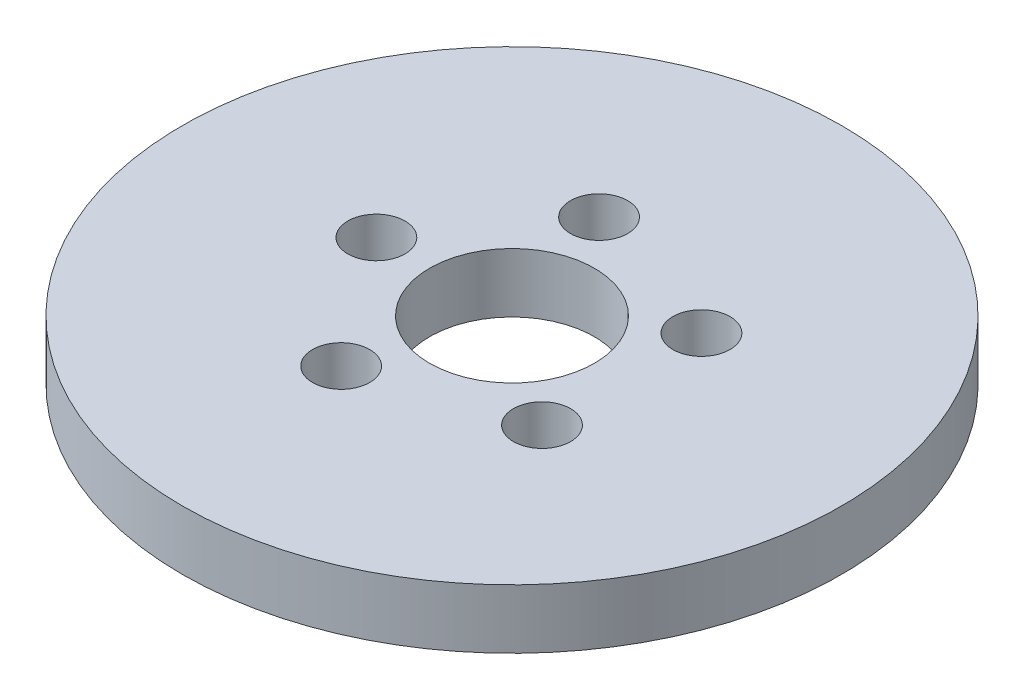
ISO-10303-21;
HEADER;
FILE_DESCRIPTION(('STEP AP214'),'2;1');
FILE_NAME('part.step','',(''),(''),'','','');
FILE_SCHEMA(('AUTOMOTIVE_DESIGN { 1 0 10303 214 1 1 1 1 }'));
ENDSEC;
DATA;
#1=APPLICATION_CONTEXT('core data for automotive mechanical design processes');
#2=APPLICATION_PROTOCOL_DEFINITION('international standard','automotive_design',2000,#1);
#3=PRODUCT_CONTEXT('',#1,'mechanical');
#4=PRODUCT('Part','Part','',(#3));
#5=PRODUCT_RELATED_PRODUCT_CATEGORY('part','',(#4));
#6=PRODUCT_DEFINITION_FORMATION('','',#4);
#7=PRODUCT_DEFINITION_CONTEXT('part definition',#1,'design');
#8=PRODUCT_DEFINITION('design','',#6,#7);
#9=PRODUCT_DEFINITION_SHAPE('','',#8);
#10=(LENGTH_UNIT() NAMED_UNIT(*) SI_UNIT(.MILLI.,.METRE.));
#11=(NAMED_UNIT(*) PLANE_ANGLE_UNIT() SI_UNIT($,.RADIAN.));
#12=(NAMED_UNIT(*) SI_UNIT($,.STERADIAN.) SOLID_ANGLE_UNIT());
#13=UNCERTAINTY_MEASURE_WITH_UNIT(LENGTH_MEASURE(1.E-05),#10,'distance_accuracy_value','');
#14=(GEOMETRIC_REPRESENTATION_CONTEXT(3) GLOBAL_UNCERTAINTY_ASSIGNED_CONTEXT((#13)) GLOBAL_UNIT_ASSIGNED_CONTEXT((#10,
#11,#12)) REPRESENTATION_CONTEXT('',''));
#15=CARTESIAN_POINT('',(0.,0.,0.));
#16=DIRECTION('',(0.,0.,1.));
#17=DIRECTION('',(1.,0.,0.));
#18=AXIS2_PLACEMENT_3D('',#15,#16,#17);
#19=CARTESIAN_POINT('',(0.,18.,0.));
#20=DIRECTION('',(0.,-1.,0.));
#21=DIRECTION('',(0.,0.,-1.));
#22=AXIS2_PLACEMENT_3D('',#19,#20,#21);
#23=CYLINDRICAL_SURFACE('',#22,100.);
#24=CARTESIAN_POINT('',(0.,18.,0.));
#25=DIRECTION('',(0.,1.,0.));
#26=DIRECTION('',(0.,0.,1.));
#27=AXIS2_PLACEMENT_3D('',#24,#25,#26);
#28=CIRCLE('',#27,100.);
#29=CARTESIAN_POINT('',(0.,18.,100.));
#30=VERTEX_POINT('',#29);
#31=EDGE_CURVE('E10',#30,#30,#28,.T.);
#32=ORIENTED_EDGE('',*,*,#31,.F.);
#33=EDGE_LOOP('',(#32));
#34=FACE_BOUND('',#33,.T.);
#35=CARTESIAN_POINT('',(0.,0.,0.));
#36=DIRECTION('',(0.,1.,0.));
#37=DIRECTION('',(0.,0.,1.));
#38=AXIS2_PLACEMENT_3D('',#35,#36,#37);
#39=CIRCLE('',#38,100.);
#40=CARTESIAN_POINT('',(0.,0.,100.));
#41=VERTEX_POINT('',#40);
#42=EDGE_CURVE('E37',#41,#41,#39,.T.);
#43=ORIENTED_EDGE('',*,*,#42,.T.);
#44=EDGE_LOOP('',(#43));
#45=FACE_BOUND('',#44,.T.);
#46=ADVANCED_FACE('F40',(#34,#45),#23,.T.);
#47=CARTESIAN_POINT('',(0.,18.,0.));
#48=DIRECTION('',(0.,1.,0.));
#49=DIRECTION('',(0.,0.,1.));
#50=AXIS2_PLACEMENT_3D('',#47,#48,#49);
#51=PLANE('',#50);
#52=CARTESIAN_POINT('',(-12.7157932514973,18.,-39.135187552256));
#53=DIRECTION('',(0.,1.,0.));
#54=DIRECTION('',(-0.95105651629515,0.,0.309016994374958));
#55=AXIS2_PLACEMENT_3D('',#52,#53,#54);
#56=CIRCLE('',#55,8.67448035976716);
#57=CARTESIAN_POINT('',(-20.9657143231282,18.,-36.4546257037162));
#58=VERTEX_POINT('',#57);
#59=EDGE_CURVE('E70',#58,#58,#56,.T.);
#60=ORIENTED_EDGE('',*,*,#59,.F.);
#61=EDGE_LOOP('',(#60));
#62=FACE_BOUND('',#61,.T.);
#63=CARTESIAN_POINT('',(33.2903789263352,18.,-24.1868760633964));
#64=DIRECTION('',(0.,1.,0.));
#65=DIRECTION('',(-0.58778525229248,0.,-0.809016994374942));
#66=AXIS2_PLACEMENT_3D('',#63,#64,#65);
#67=CIRCLE('',#66,8.67448035976716);
#68=CARTESIAN_POINT('',(28.1916472995633,18.,-31.2046780918197));
#69=VERTEX_POINT('',#68);
#70=EDGE_CURVE('E71',#69,#69,#67,.T.);
#71=ORIENTED_EDGE('',*,*,#70,.F.);
#72=EDGE_LOOP('',(#71));
#73=FACE_BOUND('',#72,.T.);
#74=CARTESIAN_POINT('',(33.2903789263355,18.,24.1868760633959));
#75=DIRECTION('',(0.,1.,0.));
#76=DIRECTION('',(0.587785252292469,0.,-0.809016994374951));
#77=AXIS2_PLACEMENT_3D('',#74,#75,#76);
#78=CIRCLE('',#77,8.67448035976716);
#79=CARTESIAN_POINT('',(38.3891105531073,18.,17.1690740349725));
#80=VERTEX_POINT('',#79);
#81=EDGE_CURVE('E78',#80,#80,#78,.T.);
#82=ORIENTED_EDGE('',*,*,#81,.F.);
#83=EDGE_LOOP('',(#82));
#84=FACE_BOUND('',#83,.T.);
#85=CARTESIAN_POINT('',(-12.7157932514968,18.,39.1351875522562));
#86=DIRECTION('',(0.,1.,0.));
#87=DIRECTION('',(0.951056516295155,0.,0.309016994374945));
#88=AXIS2_PLACEMENT_3D('',#85,#86,#87);
#89=CIRCLE('',#88,8.67448035976716);
#90=CARTESIAN_POINT('',(-4.46587217986588,18.,41.8157494007959));
#91=VERTEX_POINT('',#90);
#92=EDGE_CURVE('E61',#91,#91,#89,.T.);
#93=ORIENTED_EDGE('',*,*,#92,.F.);
#94=EDGE_LOOP('',(#93));
#95=FACE_BOUND('',#94,.T.);
#96=CARTESIAN_POINT('',(-41.149171349677,18.,0.));
#97=DIRECTION('',(0.,1.,0.));
#98=DIRECTION('',(0.,0.,1.));
#99=AXIS2_PLACEMENT_3D('',#96,#97,#98);
#100=CIRCLE('',#99,8.67448035976716);
#101=CARTESIAN_POINT('',(-41.149171349677,18.,8.67448035976716));
#102=VERTEX_POINT('',#101);
#103=EDGE_CURVE('E54',#102,#102,#100,.T.);
#104=ORIENTED_EDGE('',*,*,#103,.F.);
#105=EDGE_LOOP('',(#104));
#106=FACE_BOUND('',#105,.T.);
#107=CARTESIAN_POINT('',(0.,18.,0.));
#108=DIRECTION('',(0.,1.,0.));
#109=DIRECTION('',(0.,0.,1.));
#110=AXIS2_PLACEMENT_3D('',#107,#108,#109);
#111=CIRCLE('',#110,25.);
#112=CARTESIAN_POINT('',(0.,18.,25.));
#113=VERTEX_POINT('',#112);
#114=EDGE_CURVE('E50',#113,#113,#111,.T.);
#115=ORIENTED_EDGE('',*,*,#114,.F.);
#116=EDGE_LOOP('',(#115));
#117=FACE_BOUND('',#116,.T.);
#118=ORIENTED_EDGE('',*,*,#31,.T.);
#119=EDGE_LOOP('',(#118));
#120=FACE_BOUND('',#119,.T.);
#121=ADVANCED_FACE('F94',(#62,#73,#84,#95,#106,#117,#120),#51,.T.);
#122=CARTESIAN_POINT('',(0.,0.,0.));
#123=DIRECTION('',(0.,1.,0.));
#124=DIRECTION('',(0.,0.,1.));
#125=AXIS2_PLACEMENT_3D('',#122,#123,#124);
#126=PLANE('',#125);
#127=CARTESIAN_POINT('',(0.,0.,0.));
#128=DIRECTION('',(0.,1.,0.));
#129=DIRECTION('',(0.,0.,1.));
#130=AXIS2_PLACEMENT_3D('',#127,#128,#129);
#131=CIRCLE('',#130,25.);
#132=CARTESIAN_POINT('',(0.,0.,25.));
#133=VERTEX_POINT('',#132);
#134=EDGE_CURVE('E47',#133,#133,#131,.T.);
#135=ORIENTED_EDGE('',*,*,#134,.T.);
#136=EDGE_LOOP('',(#135));
#137=FACE_BOUND('',#136,.T.);
#138=ORIENTED_EDGE('',*,*,#42,.F.);
#139=EDGE_LOOP('',(#138));
#140=FACE_BOUND('',#139,.T.);
#141=ADVANCED_FACE('F100',(#137,#140),#126,.F.);
#142=CARTESIAN_POINT('',(0.,18.,0.));
#143=DIRECTION('',(0.,-1.,0.));
#144=DIRECTION('',(0.,0.,-1.));
#145=AXIS2_PLACEMENT_3D('',#142,#143,#144);
#146=CYLINDRICAL_SURFACE('',#145,25.);
#147=ORIENTED_EDGE('',*,*,#114,.T.);
#148=EDGE_LOOP('',(#147));
#149=FACE_BOUND('',#148,.T.);
#150=ORIENTED_EDGE('',*,*,#134,.F.);
#151=EDGE_LOOP('',(#150));
#152=FACE_BOUND('',#151,.T.);
#153=ADVANCED_FACE('F106',(#149,#152),#146,.F.);
#154=CARTESIAN_POINT('',(-41.149171349677,0.58670029231896,0.));
#155=DIRECTION('',(0.,1.,0.));
#156=DIRECTION('',(0.,0.,1.));
#157=AXIS2_PLACEMENT_3D('',#154,#155,#156);
#158=CYLINDRICAL_SURFACE('',#157,8.67448035976716);
#159=CARTESIAN_POINT('',(-41.149171349677,0.58670029231896,0.));
#160=DIRECTION('',(0.,1.,0.));
#161=DIRECTION('',(0.,0.,1.));
#162=AXIS2_PLACEMENT_3D('',#159,#160,#161);
#163=CIRCLE('',#162,8.67448035976716);
#164=CARTESIAN_POINT('',(-41.149171349677,0.58670029231896,8.67448035976716));
#165=VERTEX_POINT('',#164);
#166=EDGE_CURVE('E55',#165,#165,#163,.T.);
#167=ORIENTED_EDGE('',*,*,#166,.F.);
#168=EDGE_LOOP('',(#167));
#169=FACE_BOUND('',#168,.T.);
#170=ORIENTED_EDGE('',*,*,#103,.T.);
#171=EDGE_LOOP('',(#170));
#172=FACE_BOUND('',#171,.T.);
#173=ADVANCED_FACE('F108',(#169,#172),#158,.F.);
#174=CARTESIAN_POINT('',(-41.149171349677,0.58670029231896,0.));
#175=DIRECTION('',(0.,1.,0.));
#176=DIRECTION('',(0.,0.,1.));
#177=AXIS2_PLACEMENT_3D('',#174,#175,#176);
#178=PLANE('',#177);
#179=ORIENTED_EDGE('',*,*,#166,.T.);
#180=EDGE_LOOP('',(#179));
#181=FACE_BOUND('',#180,.T.);
#182=ADVANCED_FACE('F138',(#181),#178,.T.);
#183=CARTESIAN_POINT('',(-12.7157932514968,0.58670029231896,39.1351875522562));
#184=DIRECTION('',(0.,1.,0.));
#185=DIRECTION('',(0.,0.,1.));
#186=AXIS2_PLACEMENT_3D('',#183,#184,#185);
#187=CYLINDRICAL_SURFACE('',#186,8.67448035976716);
#188=CARTESIAN_POINT('',(-12.7157932514968,0.58670029231896,39.1351875522562));
#189=DIRECTION('',(0.,1.,0.));
#190=DIRECTION('',(0.951056516295155,0.,0.309016994374945));
#191=AXIS2_PLACEMENT_3D('',#188,#189,#190);
#192=CIRCLE('',#191,8.67448035976716);
#193=CARTESIAN_POINT('',(-4.46587217986588,0.58670029231896,41.8157494007959));
#194=VERTEX_POINT('',#193);
#195=EDGE_CURVE('E59',#194,#194,#192,.T.);
#196=ORIENTED_EDGE('',*,*,#195,.F.);
#197=EDGE_LOOP('',(#196));
#198=FACE_BOUND('',#197,.T.);
#199=ORIENTED_EDGE('',*,*,#92,.T.);
#200=EDGE_LOOP('',(#199));
#201=FACE_BOUND('',#200,.T.);
#202=ADVANCED_FACE('F150',(#198,#201),#187,.F.);
#203=CARTESIAN_POINT('',(-12.7157932514968,0.58670029231896,39.1351875522562));
#204=DIRECTION('',(0.,1.,0.));
#205=DIRECTION('',(0.951056516295155,0.,0.309016994374945));
#206=AXIS2_PLACEMENT_3D('',#203,#204,#205);
#207=PLANE('',#206);
#208=ORIENTED_EDGE('',*,*,#195,.T.);
#209=EDGE_LOOP('',(#208));
#210=FACE_BOUND('',#209,.T.);
#211=ADVANCED_FACE('F89',(#210),#207,.T.);
#212=CARTESIAN_POINT('',(33.2903789263355,0.58670029231896,24.1868760633959));
#213=DIRECTION('',(0.,1.,0.));
#214=DIRECTION('',(0.,0.,1.));
#215=AXIS2_PLACEMENT_3D('',#212,#213,#214);
#216=CYLINDRICAL_SURFACE('',#215,8.67448035976716);
#217=CARTESIAN_POINT('',(33.2903789263355,0.58670029231896,24.1868760633959));
#218=DIRECTION('',(0.,1.,0.));
#219=DIRECTION('',(0.587785252292469,0.,-0.809016994374951));
#220=AXIS2_PLACEMENT_3D('',#217,#218,#219);
#221=CIRCLE('',#220,8.67448035976716);
#222=CARTESIAN_POINT('',(38.3891105531073,0.58670029231896,17.1690740349725));
#223=VERTEX_POINT('',#222);
#224=EDGE_CURVE('E63',#223,#223,#221,.T.);
#225=ORIENTED_EDGE('',*,*,#224,.F.);
#226=EDGE_LOOP('',(#225));
#227=FACE_BOUND('',#226,.T.);
#228=ORIENTED_EDGE('',*,*,#81,.T.);
#229=EDGE_LOOP('',(#228));
#230=FACE_BOUND('',#229,.T.);
#231=ADVANCED_FACE('F87',(#227,#230),#216,.F.);
#232=CARTESIAN_POINT('',(33.2903789263355,0.58670029231896,24.1868760633959));
#233=DIRECTION('',(0.,1.,0.));
#234=DIRECTION('',(0.587785252292469,0.,-0.809016994374951));
#235=AXIS2_PLACEMENT_3D('',#232,#233,#234);
#236=PLANE('',#235);
#237=ORIENTED_EDGE('',*,*,#224,.T.);
#238=EDGE_LOOP('',(#237));
#239=FACE_BOUND('',#238,.T.);
#240=ADVANCED_FACE('F84',(#239),#236,.T.);
#241=CARTESIAN_POINT('',(33.2903789263352,0.58670029231896,-24.1868760633964));
#242=DIRECTION('',(0.,1.,0.));
#243=DIRECTION('',(0.,0.,1.));
#244=AXIS2_PLACEMENT_3D('',#241,#242,#243);
#245=CYLINDRICAL_SURFACE('',#244,8.67448035976716);
#246=CARTESIAN_POINT('',(33.2903789263352,0.58670029231896,-24.1868760633964));
#247=DIRECTION('',(0.,1.,0.));
#248=DIRECTION('',(-0.58778525229248,0.,-0.809016994374942));
#249=AXIS2_PLACEMENT_3D('',#246,#247,#248);
#250=CIRCLE('',#249,8.67448035976716);
#251=CARTESIAN_POINT('',(28.1916472995633,0.58670029231896,-31.2046780918197));
#252=VERTEX_POINT('',#251);
#253=EDGE_CURVE('E76',#252,#252,#250,.T.);
#254=ORIENTED_EDGE('',*,*,#253,.F.);
#255=EDGE_LOOP('',(#254));
#256=FACE_BOUND('',#255,.T.);
#257=ORIENTED_EDGE('',*,*,#70,.T.);
#258=EDGE_LOOP('',(#257));
#259=FACE_BOUND('',#258,.T.);
#260=ADVANCED_FACE('F185',(#256,#259),#245,.F.);
#261=CARTESIAN_POINT('',(33.2903789263352,0.58670029231896,-24.1868760633964));
#262=DIRECTION('',(0.,1.,0.));
#263=DIRECTION('',(-0.58778525229248,0.,-0.809016994374942));
#264=AXIS2_PLACEMENT_3D('',#261,#262,#263);
#265=PLANE('',#264);
#266=ORIENTED_EDGE('',*,*,#253,.T.);
#267=EDGE_LOOP('',(#266));
#268=FACE_BOUND('',#267,.T.);
#269=ADVANCED_FACE('F189',(#268),#265,.T.);
#270=CARTESIAN_POINT('',(-12.7157932514973,0.58670029231896,-39.135187552256));
#271=DIRECTION('',(0.,1.,0.));
#272=DIRECTION('',(0.,0.,1.));
#273=AXIS2_PLACEMENT_3D('',#270,#271,#272);
#274=CYLINDRICAL_SURFACE('',#273,8.67448035976716);
#275=CARTESIAN_POINT('',(-12.7157932514973,0.58670029231896,-39.135187552256));
#276=DIRECTION('',(0.,1.,0.));
#277=DIRECTION('',(-0.95105651629515,0.,0.309016994374958));
#278=AXIS2_PLACEMENT_3D('',#275,#276,#277);
#279=CIRCLE('',#278,8.67448035976716);
#280=CARTESIAN_POINT('',(-20.9657143231282,0.58670029231896,-36.4546257037162));
#281=VERTEX_POINT('',#280);
#282=EDGE_CURVE('E69',#281,#281,#279,.T.);
#283=ORIENTED_EDGE('',*,*,#282,.F.);
#284=EDGE_LOOP('',(#283));
#285=FACE_BOUND('',#284,.T.);
#286=ORIENTED_EDGE('',*,*,#59,.T.);
#287=EDGE_LOOP('',(#286));
#288=FACE_BOUND('',#287,.T.);
#289=ADVANCED_FACE('F200',(#285,#288),#274,.F.);
#290=CARTESIAN_POINT('',(-12.7157932514973,0.58670029231896,-39.135187552256));
#291=DIRECTION('',(0.,1.,0.));
#292=DIRECTION('',(-0.95105651629515,0.,0.309016994374958));
#293=AXIS2_PLACEMENT_3D('',#290,#291,#292);
#294=PLANE('',#293);
#295=ORIENTED_EDGE('',*,*,#282,.T.);
#296=EDGE_LOOP('',(#295));
#297=FACE_BOUND('',#296,.T.);
#298=ADVANCED_FACE('F208',(#297),#294,.T.);
#299=CLOSED_SHELL('',(#46,#121,#141,#153,#173,#182,#202,#211,#231,#240,#260,#269,#289,#298));
#300=MANIFOLD_SOLID_BREP('B2',#299);
#301=ADVANCED_BREP_SHAPE_REPRESENTATION('',(#18,#300),#14);
#302=SHAPE_DEFINITION_REPRESENTATION(#9,#301);
ENDSEC;
END-ISO-10303-21;
